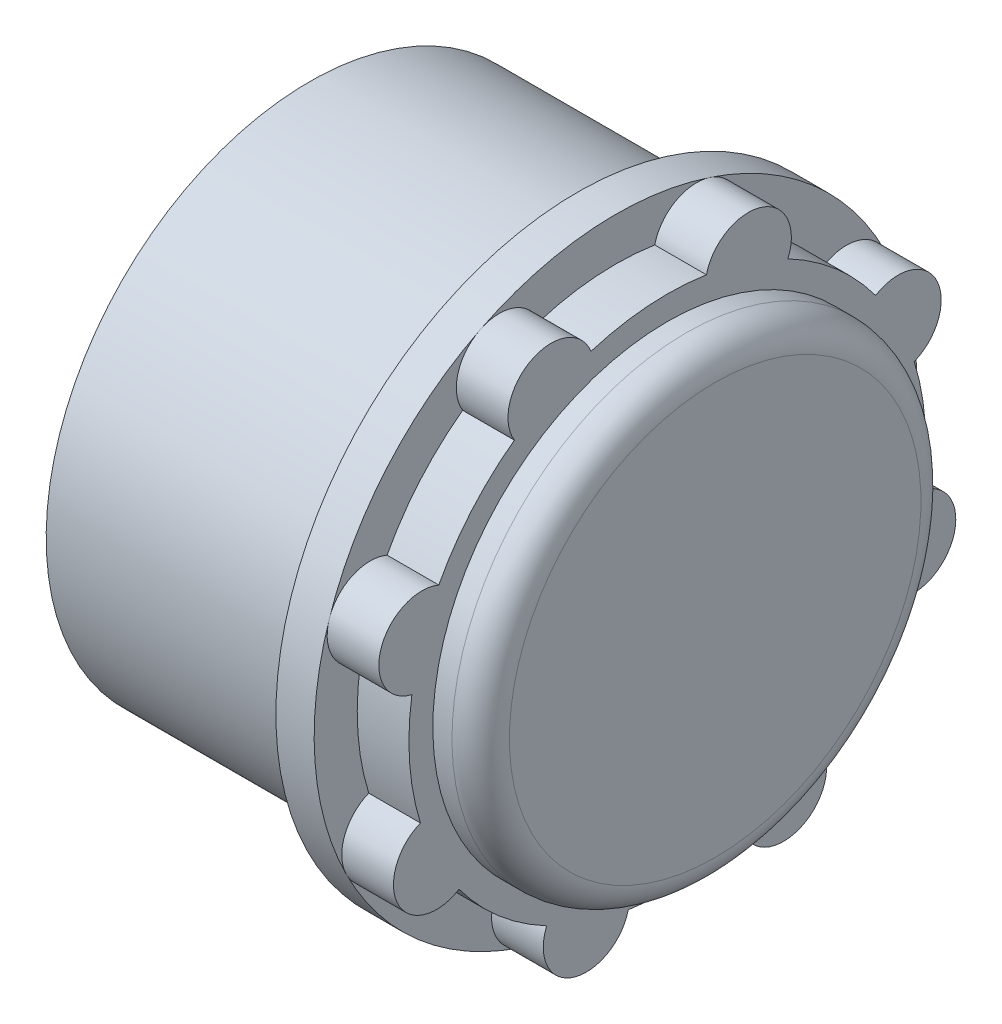
ISO-10303-21;
HEADER;
FILE_DESCRIPTION(('STEP AP214'),'2;1');
FILE_NAME('part.step','',(''),(''),'','','');
FILE_SCHEMA(('AUTOMOTIVE_DESIGN { 1 0 10303 214 1 1 1 1 }'));
ENDSEC;
DATA;
#1=APPLICATION_CONTEXT('core data for automotive mechanical design processes');
#2=APPLICATION_PROTOCOL_DEFINITION('international standard','automotive_design',2000,#1);
#3=PRODUCT_CONTEXT('',#1,'mechanical');
#4=PRODUCT('Part','Part','',(#3));
#5=PRODUCT_RELATED_PRODUCT_CATEGORY('part','',(#4));
#6=PRODUCT_DEFINITION_FORMATION('','',#4);
#7=PRODUCT_DEFINITION_CONTEXT('part definition',#1,'design');
#8=PRODUCT_DEFINITION('design','',#6,#7);
#9=PRODUCT_DEFINITION_SHAPE('','',#8);
#10=(LENGTH_UNIT() NAMED_UNIT(*) SI_UNIT(.MILLI.,.METRE.));
#11=(NAMED_UNIT(*) PLANE_ANGLE_UNIT() SI_UNIT($,.RADIAN.));
#12=(NAMED_UNIT(*) SI_UNIT($,.STERADIAN.) SOLID_ANGLE_UNIT());
#13=UNCERTAINTY_MEASURE_WITH_UNIT(LENGTH_MEASURE(1.E-05),#10,'distance_accuracy_value','');
#14=(GEOMETRIC_REPRESENTATION_CONTEXT(3) GLOBAL_UNCERTAINTY_ASSIGNED_CONTEXT((#13)) GLOBAL_UNIT_ASSIGNED_CONTEXT((#10,
#11,#12)) REPRESENTATION_CONTEXT('',''));
#15=CARTESIAN_POINT('',(0.,0.,0.));
#16=DIRECTION('',(0.,0.,1.));
#17=DIRECTION('',(1.,0.,0.));
#18=AXIS2_PLACEMENT_3D('',#15,#16,#17);
#19=CARTESIAN_POINT('',(2.,0.,0.));
#20=DIRECTION('',(1.,0.,0.));
#21=DIRECTION('',(0.,0.,-1.));
#22=AXIS2_PLACEMENT_3D('',#19,#20,#21);
#23=PLANE('',#22);
#24=CARTESIAN_POINT('',(2.,0.,0.));
#25=DIRECTION('',(1.,0.,0.));
#26=DIRECTION('',(0.,1.,0.));
#27=AXIS2_PLACEMENT_3D('',#24,#25,#26);
#28=CIRCLE('',#27,13.5);
#29=CARTESIAN_POINT('',(2.,-2.0425042619632,-13.3445935247149));
#30=VERTEX_POINT('',#29);
#31=CARTESIAN_POINT('',(2.,3.9869170359937,-12.8978483689375));
#32=VERTEX_POINT('',#31);
#33=EDGE_CURVE('E776',#30,#32,#28,.T.);
#34=ORIENTED_EDGE('',*,*,#33,.F.);
#35=CARTESIAN_POINT('',(2.,-4.23049904831431,-12.8200186350181));
#36=DIRECTION('',(1.,0.,0.));
#37=DIRECTION('',(0.,1.,0.));
#38=AXIS2_PLACEMENT_3D('',#35,#36,#37);
#39=CIRCLE('',#38,2.25);
#40=CARTESIAN_POINT('',(2.,-4.93558222303336,-14.9566884075211));
#41=VERTEX_POINT('',#40);
#42=EDGE_CURVE('E408',#41,#30,#39,.T.);
#43=ORIENTED_EDGE('',*,*,#42,.F.);
#44=CARTESIAN_POINT('',(2.,0.,0.));
#45=DIRECTION('',(1.,0.,0.));
#46=DIRECTION('',(0.,0.,-1.));
#47=AXIS2_PLACEMENT_3D('',#44,#45,#46);
#48=CIRCLE('',#47,15.75);
#49=CARTESIAN_POINT('',(2.,7.08599213804178,-14.0659594560631));
#50=VERTEX_POINT('',#49);
#51=EDGE_CURVE('E229',#41,#50,#48,.T.);
#52=ORIENTED_EDGE('',*,*,#51,.T.);
#53=CARTESIAN_POINT('',(2.,6.07370754689295,-12.0565366766255));
#54=DIRECTION('',(1.,0.,0.));
#55=DIRECTION('',(0.,1.,0.));
#56=AXIS2_PLACEMENT_3D('',#53,#54,#55);
#57=CIRCLE('',#56,2.25);
#58=EDGE_CURVE('E775',#32,#50,#57,.T.);
#59=ORIENTED_EDGE('',*,*,#58,.F.);
#60=EDGE_LOOP('',(#34,#43,#52,#59));
#61=FACE_BOUND('',#60,.T.);
#62=ADVANCED_FACE('F55',(#61),#23,.T.);
#63=CARTESIAN_POINT('',(2.,7.9917839592674,-10.8803211877406));
#64=VERTEX_POINT('',#63);
#65=EDGE_CURVE('E742',#50,#64,#57,.T.);
#66=ORIENTED_EDGE('',*,*,#65,.F.);
#67=CARTESIAN_POINT('',(2.,14.9566884075212,-4.93558222303331));
#68=VERTEX_POINT('',#67);
#69=EDGE_CURVE('E235',#50,#68,#48,.T.);
#70=ORIENTED_EDGE('',*,*,#69,.T.);
#71=CARTESIAN_POINT('',(2.,12.8200186350181,-4.23049904831426));
#72=DIRECTION('',(1.,0.,0.));
#73=DIRECTION('',(0.,1.,0.));
#74=AXIS2_PLACEMENT_3D('',#71,#72,#73);
#75=CIRCLE('',#74,2.25000000000001);
#76=CARTESIAN_POINT('',(2.,11.9393321165709,-6.30097997221221));
#77=VERTEX_POINT('',#76);
#78=EDGE_CURVE('E332',#77,#68,#75,.T.);
#79=ORIENTED_EDGE('',*,*,#78,.F.);
#80=CARTESIAN_POINT('',(2.,0.,0.));
#81=DIRECTION('',(1.,0.,0.));
#82=DIRECTION('',(0.,1.,0.));
#83=AXIS2_PLACEMENT_3D('',#80,#81,#82);
#84=CIRCLE('',#83,13.5);
#85=EDGE_CURVE('E739',#64,#77,#84,.T.);
#86=ORIENTED_EDGE('',*,*,#85,.F.);
#87=EDGE_LOOP('',(#66,#70,#79,#86));
#88=FACE_BOUND('',#87,.T.);
#89=ADVANCED_FACE('F264',(#88),#23,.T.);
#90=CARTESIAN_POINT('',(2.,-6.30097997221226,-11.9393321165708));
#91=VERTEX_POINT('',#90);
#92=EDGE_CURVE('E779',#91,#41,#39,.T.);
#93=ORIENTED_EDGE('',*,*,#92,.F.);
#94=CARTESIAN_POINT('',(2.,0.,0.));
#95=DIRECTION('',(1.,0.,0.));
#96=DIRECTION('',(0.,1.,0.));
#97=AXIS2_PLACEMENT_3D('',#94,#95,#96);
#98=CIRCLE('',#97,13.5);
#99=CARTESIAN_POINT('',(2.,-10.8803211877406,-7.99178395926736));
#100=VERTEX_POINT('',#99);
#101=EDGE_CURVE('E787',#100,#91,#98,.T.);
#102=ORIENTED_EDGE('',*,*,#101,.F.);
#103=CARTESIAN_POINT('',(2.,-12.0565366766255,-6.07370754689291));
#104=DIRECTION('',(1.,0.,0.));
#105=DIRECTION('',(0.,1.,0.));
#106=AXIS2_PLACEMENT_3D('',#103,#104,#105);
#107=CIRCLE('',#106,2.25);
#108=CARTESIAN_POINT('',(2.,-14.0659594560631,-7.08599213804173));
#109=VERTEX_POINT('',#108);
#110=EDGE_CURVE('E782',#109,#100,#107,.T.);
#111=ORIENTED_EDGE('',*,*,#110,.F.);
#112=EDGE_CURVE('E762',#109,#41,#48,.T.);
#113=ORIENTED_EDGE('',*,*,#112,.T.);
#114=EDGE_LOOP('',(#93,#102,#111,#113));
#115=FACE_BOUND('',#114,.T.);
#116=ADVANCED_FACE('F271',(#115),#23,.T.);
#117=CARTESIAN_POINT('',(2.,-12.8978483689375,-3.98691703599366));
#118=VERTEX_POINT('',#117);
#119=EDGE_CURVE('E792',#118,#109,#107,.T.);
#120=ORIENTED_EDGE('',*,*,#119,.F.);
#121=CARTESIAN_POINT('',(2.,0.,0.));
#122=DIRECTION('',(1.,0.,0.));
#123=DIRECTION('',(0.,1.,0.));
#124=AXIS2_PLACEMENT_3D('',#121,#122,#123);
#125=CIRCLE('',#124,13.5);
#126=CARTESIAN_POINT('',(2.,-13.3445935247149,2.04250426196324));
#127=VERTEX_POINT('',#126);
#128=EDGE_CURVE('E797',#127,#118,#125,.T.);
#129=ORIENTED_EDGE('',*,*,#128,.F.);
#130=CARTESIAN_POINT('',(2.,-12.8200186350181,4.23049904831435));
#131=DIRECTION('',(1.,0.,0.));
#132=DIRECTION('',(0.,1.,0.));
#133=AXIS2_PLACEMENT_3D('',#130,#131,#132);
#134=CIRCLE('',#133,2.25);
#135=CARTESIAN_POINT('',(2.00000000000001,-14.9566884075211,4.93558222303341));
#136=VERTEX_POINT('',#135);
#137=EDGE_CURVE('E330',#136,#127,#134,.T.);
#138=ORIENTED_EDGE('',*,*,#137,.F.);
#139=EDGE_CURVE('E757',#136,#109,#48,.T.);
#140=ORIENTED_EDGE('',*,*,#139,.T.);
#141=EDGE_LOOP('',(#120,#129,#138,#140));
#142=FACE_BOUND('',#141,.T.);
#143=ADVANCED_FACE('F682',(#142),#23,.T.);
#144=CARTESIAN_POINT('',(2.,13.3445935247149,-2.04250426196314));
#145=VERTEX_POINT('',#144);
#146=EDGE_CURVE('E321',#68,#145,#75,.T.);
#147=ORIENTED_EDGE('',*,*,#146,.F.);
#148=CARTESIAN_POINT('',(2.,14.0659594560631,7.08599213804183));
#149=VERTEX_POINT('',#148);
#150=EDGE_CURVE('E238',#68,#149,#48,.T.);
#151=ORIENTED_EDGE('',*,*,#150,.T.);
#152=CARTESIAN_POINT('',(2.,12.0565366766255,6.07370754689299));
#153=DIRECTION('',(1.,0.,0.));
#154=DIRECTION('',(0.,1.,0.));
#155=AXIS2_PLACEMENT_3D('',#152,#153,#154);
#156=CIRCLE('',#155,2.25);
#157=CARTESIAN_POINT('',(2.,12.8978483689375,3.98691703599376));
#158=VERTEX_POINT('',#157);
#159=EDGE_CURVE('E340',#158,#149,#156,.T.);
#160=ORIENTED_EDGE('',*,*,#159,.F.);
#161=CARTESIAN_POINT('',(2.,0.,0.));
#162=DIRECTION('',(1.,0.,0.));
#163=DIRECTION('',(0.,1.,0.));
#164=AXIS2_PLACEMENT_3D('',#161,#162,#163);
#165=CIRCLE('',#164,13.5);
#166=EDGE_CURVE('E216',#145,#158,#165,.T.);
#167=ORIENTED_EDGE('',*,*,#166,.F.);
#168=EDGE_LOOP('',(#147,#151,#160,#167));
#169=FACE_BOUND('',#168,.T.);
#170=ADVANCED_FACE('F294',(#169),#23,.T.);
#171=CARTESIAN_POINT('',(2.,-11.9393321165708,6.30097997221228));
#172=VERTEX_POINT('',#171);
#173=EDGE_CURVE('E316',#172,#136,#134,.T.);
#174=ORIENTED_EDGE('',*,*,#173,.F.);
#175=CARTESIAN_POINT('',(2.,0.,0.));
#176=DIRECTION('',(1.,0.,0.));
#177=DIRECTION('',(0.,1.,0.));
#178=AXIS2_PLACEMENT_3D('',#175,#176,#177);
#179=CIRCLE('',#178,13.5);
#180=CARTESIAN_POINT('',(2.,-7.99178395926732,10.8803211877406));
#181=VERTEX_POINT('',#180);
#182=EDGE_CURVE('E309',#181,#172,#179,.T.);
#183=ORIENTED_EDGE('',*,*,#182,.F.);
#184=CARTESIAN_POINT('',(2.,-6.07370754689287,12.0565366766255));
#185=DIRECTION('',(1.,0.,0.));
#186=DIRECTION('',(0.,1.,0.));
#187=AXIS2_PLACEMENT_3D('',#184,#185,#186);
#188=CIRCLE('',#187,2.25);
#189=CARTESIAN_POINT('',(2.,-7.08599213804168,14.0659594560631));
#190=VERTEX_POINT('',#189);
#191=EDGE_CURVE('E311',#190,#181,#188,.T.);
#192=ORIENTED_EDGE('',*,*,#191,.F.);
#193=EDGE_CURVE('E754',#190,#136,#48,.T.);
#194=ORIENTED_EDGE('',*,*,#193,.T.);
#195=EDGE_LOOP('',(#174,#183,#192,#194));
#196=FACE_BOUND('',#195,.T.);
#197=ADVANCED_FACE('F289',(#196),#23,.T.);
#198=CARTESIAN_POINT('',(2.,-3.98691703599362,12.8978483689375));
#199=VERTEX_POINT('',#198);
#200=EDGE_CURVE('E299',#199,#190,#188,.T.);
#201=ORIENTED_EDGE('',*,*,#200,.F.);
#202=CARTESIAN_POINT('',(2.,0.,0.));
#203=DIRECTION('',(1.,0.,0.));
#204=DIRECTION('',(0.,1.,0.));
#205=AXIS2_PLACEMENT_3D('',#202,#203,#204);
#206=CIRCLE('',#205,13.5);
#207=CARTESIAN_POINT('',(2.,2.04250426196328,13.3445935247149));
#208=VERTEX_POINT('',#207);
#209=EDGE_CURVE('E302',#208,#199,#206,.T.);
#210=ORIENTED_EDGE('',*,*,#209,.F.);
#211=CARTESIAN_POINT('',(2.,4.2304990483144,12.8200186350181));
#212=DIRECTION('',(1.,0.,0.));
#213=DIRECTION('',(0.,1.,0.));
#214=AXIS2_PLACEMENT_3D('',#211,#212,#213);
#215=CIRCLE('',#214,2.25000000000001);
#216=CARTESIAN_POINT('',(2.,4.93558222303346,14.9566884075211));
#217=VERTEX_POINT('',#216);
#218=EDGE_CURVE('E322',#217,#208,#215,.T.);
#219=ORIENTED_EDGE('',*,*,#218,.F.);
#220=EDGE_CURVE('E304',#217,#190,#48,.T.);
#221=ORIENTED_EDGE('',*,*,#220,.T.);
#222=EDGE_LOOP('',(#201,#210,#219,#221));
#223=FACE_BOUND('',#222,.T.);
#224=ADVANCED_FACE('F280',(#223),#23,.T.);
#225=CARTESIAN_POINT('',(2.,0.,0.));
#226=DIRECTION('',(-1.,0.,0.));
#227=DIRECTION('',(0.,0.,1.));
#228=AXIS2_PLACEMENT_3D('',#225,#226,#227);
#229=CYLINDRICAL_SURFACE('',#228,15.75);
#230=ORIENTED_EDGE('',*,*,#69,.F.);
#231=ORIENTED_EDGE('',*,*,#51,.F.);
#232=ORIENTED_EDGE('',*,*,#112,.F.);
#233=ORIENTED_EDGE('',*,*,#139,.F.);
#234=ORIENTED_EDGE('',*,*,#193,.F.);
#235=ORIENTED_EDGE('',*,*,#220,.F.);
#236=EDGE_CURVE('E748',#149,#217,#48,.T.);
#237=ORIENTED_EDGE('',*,*,#236,.F.);
#238=ORIENTED_EDGE('',*,*,#150,.F.);
#239=EDGE_LOOP('',(#230,#231,#232,#233,#234,#235,#237,#238));
#240=FACE_BOUND('',#239,.T.);
#241=CARTESIAN_POINT('',(0.,0.,0.));
#242=DIRECTION('',(1.,0.,0.));
#243=DIRECTION('',(0.,0.,-1.));
#244=AXIS2_PLACEMENT_3D('',#241,#242,#243);
#245=CIRCLE('',#244,15.75);
#246=CARTESIAN_POINT('',(0.,0.,-15.75));
#247=VERTEX_POINT('',#246);
#248=EDGE_CURVE('E223',#247,#247,#245,.T.);
#249=ORIENTED_EDGE('',*,*,#248,.T.);
#250=EDGE_LOOP('',(#249));
#251=FACE_BOUND('',#250,.T.);
#252=ADVANCED_FACE('F278',(#240,#251),#229,.T.);
#253=CARTESIAN_POINT('',(2.,10.8803211877405,7.99178395926743));
#254=VERTEX_POINT('',#253);
#255=EDGE_CURVE('E221',#149,#254,#156,.T.);
#256=ORIENTED_EDGE('',*,*,#255,.F.);
#257=ORIENTED_EDGE('',*,*,#236,.T.);
#258=CARTESIAN_POINT('',(2.,6.30097997221233,11.9393321165708));
#259=VERTEX_POINT('',#258);
#260=EDGE_CURVE('E318',#259,#217,#215,.T.);
#261=ORIENTED_EDGE('',*,*,#260,.F.);
#262=CARTESIAN_POINT('',(2.,0.,0.));
#263=DIRECTION('',(1.,0.,0.));
#264=DIRECTION('',(0.,1.,0.));
#265=AXIS2_PLACEMENT_3D('',#262,#263,#264);
#266=CIRCLE('',#265,13.5);
#267=EDGE_CURVE('E343',#254,#259,#266,.T.);
#268=ORIENTED_EDGE('',*,*,#267,.F.);
#269=EDGE_LOOP('',(#256,#257,#261,#268));
#270=FACE_BOUND('',#269,.T.);
#271=ADVANCED_FACE('F267',(#270),#23,.T.);
#272=CARTESIAN_POINT('',(0.,0.,0.));
#273=DIRECTION('',(1.,0.,0.));
#274=DIRECTION('',(0.,0.,-1.));
#275=AXIS2_PLACEMENT_3D('',#272,#273,#274);
#276=PLANE('',#275);
#277=CARTESIAN_POINT('',(0.,0.,0.));
#278=DIRECTION('',(-1.,0.,0.));
#279=DIRECTION('',(0.,-1.,0.));
#280=AXIS2_PLACEMENT_3D('',#277,#278,#279);
#281=CIRCLE('',#280,13.75);
#282=CARTESIAN_POINT('',(0.,-13.75,0.));
#283=VERTEX_POINT('',#282);
#284=EDGE_CURVE('E245',#283,#283,#281,.T.);
#285=ORIENTED_EDGE('',*,*,#284,.F.);
#286=EDGE_LOOP('',(#285));
#287=FACE_BOUND('',#286,.T.);
#288=ORIENTED_EDGE('',*,*,#248,.F.);
#289=EDGE_LOOP('',(#288));
#290=FACE_BOUND('',#289,.T.);
#291=ADVANCED_FACE('F277',(#287,#290),#276,.F.);
#292=CARTESIAN_POINT('',(4.7,12.0565366766255,6.07370754689299));
#293=DIRECTION('',(-1.,0.,0.));
#294=DIRECTION('',(0.,-1.,0.));
#295=AXIS2_PLACEMENT_3D('',#292,#293,#294);
#296=CYLINDRICAL_SURFACE('',#295,2.25);
#297=ORIENTED_EDGE('',*,*,#159,.T.);
#298=ORIENTED_EDGE('',*,*,#255,.T.);
#299=DIRECTION('',(-1.,0.,0.));
#300=VECTOR('',#299,1.);
#301=CARTESIAN_POINT('',(4.7,10.8803211877405,7.99178395926743));
#302=LINE('',#301,#300);
#303=CARTESIAN_POINT('',(4.7,10.8803211877405,7.99178395926743));
#304=VERTEX_POINT('',#303);
#305=EDGE_CURVE('E200',#304,#254,#302,.T.);
#306=ORIENTED_EDGE('',*,*,#305,.F.);
#307=CARTESIAN_POINT('',(4.7,12.0565366766255,6.07370754689299));
#308=DIRECTION('',(1.,0.,0.));
#309=DIRECTION('',(0.,1.,0.));
#310=AXIS2_PLACEMENT_3D('',#307,#308,#309);
#311=CIRCLE('',#310,2.25);
#312=CARTESIAN_POINT('',(4.7,12.8978483689375,3.98691703599376));
#313=VERTEX_POINT('',#312);
#314=EDGE_CURVE('E207',#313,#304,#311,.T.);
#315=ORIENTED_EDGE('',*,*,#314,.F.);
#316=DIRECTION('',(-1.,0.,0.));
#317=VECTOR('',#316,1.);
#318=CARTESIAN_POINT('',(4.7,12.8978483689375,3.98691703599376));
#319=LINE('',#318,#317);
#320=EDGE_CURVE('E354',#313,#158,#319,.T.);
#321=ORIENTED_EDGE('',*,*,#320,.T.);
#322=EDGE_LOOP('',(#297,#298,#306,#315,#321));
#323=FACE_BOUND('',#322,.T.);
#324=ADVANCED_FACE('F220',(#323),#296,.T.);
#325=CARTESIAN_POINT('',(4.7,0.,0.));
#326=DIRECTION('',(-1.,0.,0.));
#327=DIRECTION('',(0.,-1.,0.));
#328=AXIS2_PLACEMENT_3D('',#325,#326,#327);
#329=CYLINDRICAL_SURFACE('',#328,13.5);
#330=ORIENTED_EDGE('',*,*,#267,.T.);
#331=DIRECTION('',(-1.,0.,0.));
#332=VECTOR('',#331,1.);
#333=CARTESIAN_POINT('',(4.7,6.30097997221233,11.9393321165708));
#334=LINE('',#333,#332);
#335=CARTESIAN_POINT('',(4.7,6.30097997221233,11.9393321165708));
#336=VERTEX_POINT('',#335);
#337=EDGE_CURVE('E202',#336,#259,#334,.T.);
#338=ORIENTED_EDGE('',*,*,#337,.F.);
#339=CARTESIAN_POINT('',(4.7,0.,0.));
#340=DIRECTION('',(1.,0.,0.));
#341=DIRECTION('',(0.,1.,0.));
#342=AXIS2_PLACEMENT_3D('',#339,#340,#341);
#343=CIRCLE('',#342,13.5);
#344=EDGE_CURVE('E195',#304,#336,#343,.T.);
#345=ORIENTED_EDGE('',*,*,#344,.F.);
#346=ORIENTED_EDGE('',*,*,#305,.T.);
#347=EDGE_LOOP('',(#330,#338,#345,#346));
#348=FACE_BOUND('',#347,.T.);
#349=ADVANCED_FACE('F198',(#348),#329,.T.);
#350=CARTESIAN_POINT('',(4.7,4.2304990483144,12.8200186350181));
#351=DIRECTION('',(-1.,0.,0.));
#352=DIRECTION('',(0.,-1.,0.));
#353=AXIS2_PLACEMENT_3D('',#350,#351,#352);
#354=CYLINDRICAL_SURFACE('',#353,2.25000000000001);
#355=ORIENTED_EDGE('',*,*,#260,.T.);
#356=ORIENTED_EDGE('',*,*,#218,.T.);
#357=DIRECTION('',(-1.,0.,0.));
#358=VECTOR('',#357,1.);
#359=CARTESIAN_POINT('',(4.7,2.04250426196328,13.3445935247149));
#360=LINE('',#359,#358);
#361=CARTESIAN_POINT('',(4.7,2.04250426196328,13.3445935247149));
#362=VERTEX_POINT('',#361);
#363=EDGE_CURVE('E231',#362,#208,#360,.T.);
#364=ORIENTED_EDGE('',*,*,#363,.F.);
#365=CARTESIAN_POINT('',(4.7,4.2304990483144,12.8200186350181));
#366=DIRECTION('',(1.,0.,0.));
#367=DIRECTION('',(0.,1.,0.));
#368=AXIS2_PLACEMENT_3D('',#365,#366,#367);
#369=CIRCLE('',#368,2.25000000000001);
#370=EDGE_CURVE('E206',#336,#362,#369,.T.);
#371=ORIENTED_EDGE('',*,*,#370,.F.);
#372=ORIENTED_EDGE('',*,*,#337,.T.);
#373=EDGE_LOOP('',(#355,#356,#364,#371,#372));
#374=FACE_BOUND('',#373,.T.);
#375=ADVANCED_FACE('F500',(#374),#354,.T.);
#376=CARTESIAN_POINT('',(4.7,0.,0.));
#377=DIRECTION('',(-1.,0.,0.));
#378=DIRECTION('',(0.,-1.,0.));
#379=AXIS2_PLACEMENT_3D('',#376,#377,#378);
#380=CYLINDRICAL_SURFACE('',#379,13.5);
#381=ORIENTED_EDGE('',*,*,#209,.T.);
#382=DIRECTION('',(-1.,0.,0.));
#383=VECTOR('',#382,1.);
#384=CARTESIAN_POINT('',(4.7,-3.98691703599362,12.8978483689375));
#385=LINE('',#384,#383);
#386=CARTESIAN_POINT('',(4.7,-3.98691703599362,12.8978483689375));
#387=VERTEX_POINT('',#386);
#388=EDGE_CURVE('E831',#387,#199,#385,.T.);
#389=ORIENTED_EDGE('',*,*,#388,.F.);
#390=CARTESIAN_POINT('',(4.7,0.,0.));
#391=DIRECTION('',(1.,0.,0.));
#392=DIRECTION('',(0.,1.,0.));
#393=AXIS2_PLACEMENT_3D('',#390,#391,#392);
#394=CIRCLE('',#393,13.5);
#395=EDGE_CURVE('E398',#362,#387,#394,.T.);
#396=ORIENTED_EDGE('',*,*,#395,.F.);
#397=ORIENTED_EDGE('',*,*,#363,.T.);
#398=EDGE_LOOP('',(#381,#389,#396,#397));
#399=FACE_BOUND('',#398,.T.);
#400=ADVANCED_FACE('F497',(#399),#380,.T.);
#401=CARTESIAN_POINT('',(4.7,-6.07370754689287,12.0565366766255));
#402=DIRECTION('',(-1.,0.,0.));
#403=DIRECTION('',(0.,-1.,0.));
#404=AXIS2_PLACEMENT_3D('',#401,#402,#403);
#405=CYLINDRICAL_SURFACE('',#404,2.25);
#406=ORIENTED_EDGE('',*,*,#200,.T.);
#407=ORIENTED_EDGE('',*,*,#191,.T.);
#408=DIRECTION('',(-1.,0.,0.));
#409=VECTOR('',#408,1.);
#410=CARTESIAN_POINT('',(4.7,-7.99178395926732,10.8803211877406));
#411=LINE('',#410,#409);
#412=CARTESIAN_POINT('',(4.7,-7.99178395926732,10.8803211877406));
#413=VERTEX_POINT('',#412);
#414=EDGE_CURVE('E824',#413,#181,#411,.T.);
#415=ORIENTED_EDGE('',*,*,#414,.F.);
#416=CARTESIAN_POINT('',(4.7,-6.07370754689287,12.0565366766255));
#417=DIRECTION('',(1.,0.,0.));
#418=DIRECTION('',(0.,1.,0.));
#419=AXIS2_PLACEMENT_3D('',#416,#417,#418);
#420=CIRCLE('',#419,2.25);
#421=EDGE_CURVE('E394',#387,#413,#420,.T.);
#422=ORIENTED_EDGE('',*,*,#421,.F.);
#423=ORIENTED_EDGE('',*,*,#388,.T.);
#424=EDGE_LOOP('',(#406,#407,#415,#422,#423));
#425=FACE_BOUND('',#424,.T.);
#426=ADVANCED_FACE('F493',(#425),#405,.T.);
#427=CARTESIAN_POINT('',(4.7,0.,0.));
#428=DIRECTION('',(-1.,0.,0.));
#429=DIRECTION('',(0.,-1.,0.));
#430=AXIS2_PLACEMENT_3D('',#427,#428,#429);
#431=CYLINDRICAL_SURFACE('',#430,13.5);
#432=ORIENTED_EDGE('',*,*,#182,.T.);
#433=DIRECTION('',(-1.,0.,0.));
#434=VECTOR('',#433,1.);
#435=CARTESIAN_POINT('',(4.7,-11.9393321165708,6.30097997221228));
#436=LINE('',#435,#434);
#437=CARTESIAN_POINT('',(4.7,-11.9393321165708,6.30097997221228));
#438=VERTEX_POINT('',#437);
#439=EDGE_CURVE('E819',#438,#172,#436,.T.);
#440=ORIENTED_EDGE('',*,*,#439,.F.);
#441=CARTESIAN_POINT('',(4.7,0.,0.));
#442=DIRECTION('',(1.,0.,0.));
#443=DIRECTION('',(0.,1.,0.));
#444=AXIS2_PLACEMENT_3D('',#441,#442,#443);
#445=CIRCLE('',#444,13.5);
#446=EDGE_CURVE('E390',#413,#438,#445,.T.);
#447=ORIENTED_EDGE('',*,*,#446,.F.);
#448=ORIENTED_EDGE('',*,*,#414,.T.);
#449=EDGE_LOOP('',(#432,#440,#447,#448));
#450=FACE_BOUND('',#449,.T.);
#451=ADVANCED_FACE('F489',(#450),#431,.T.);
#452=CARTESIAN_POINT('',(4.70000000000001,-12.8200186350181,4.23049904831435));
#453=DIRECTION('',(-1.,0.,0.));
#454=DIRECTION('',(0.,-1.,0.));
#455=AXIS2_PLACEMENT_3D('',#452,#453,#454);
#456=CYLINDRICAL_SURFACE('',#455,2.25);
#457=ORIENTED_EDGE('',*,*,#173,.T.);
#458=ORIENTED_EDGE('',*,*,#137,.T.);
#459=DIRECTION('',(-1.,0.,0.));
#460=VECTOR('',#459,1.);
#461=CARTESIAN_POINT('',(4.7,-13.3445935247149,2.04250426196324));
#462=LINE('',#461,#460);
#463=CARTESIAN_POINT('',(4.7,-13.3445935247149,2.04250426196324));
#464=VERTEX_POINT('',#463);
#465=EDGE_CURVE('E817',#464,#127,#462,.T.);
#466=ORIENTED_EDGE('',*,*,#465,.F.);
#467=CARTESIAN_POINT('',(4.70000000000001,-12.8200186350181,4.23049904831435));
#468=DIRECTION('',(1.,0.,0.));
#469=DIRECTION('',(0.,1.,0.));
#470=AXIS2_PLACEMENT_3D('',#467,#468,#469);
#471=CIRCLE('',#470,2.25);
#472=EDGE_CURVE('E386',#438,#464,#471,.T.);
#473=ORIENTED_EDGE('',*,*,#472,.F.);
#474=ORIENTED_EDGE('',*,*,#439,.T.);
#475=EDGE_LOOP('',(#457,#458,#466,#473,#474));
#476=FACE_BOUND('',#475,.T.);
#477=ADVANCED_FACE('F485',(#476),#456,.T.);
#478=CARTESIAN_POINT('',(4.7,0.,0.));
#479=DIRECTION('',(-1.,0.,0.));
#480=DIRECTION('',(0.,-1.,0.));
#481=AXIS2_PLACEMENT_3D('',#478,#479,#480);
#482=CYLINDRICAL_SURFACE('',#481,13.5);
#483=ORIENTED_EDGE('',*,*,#128,.T.);
#484=DIRECTION('',(-1.,0.,0.));
#485=VECTOR('',#484,1.);
#486=CARTESIAN_POINT('',(4.7,-12.8978483689375,-3.98691703599366));
#487=LINE('',#486,#485);
#488=CARTESIAN_POINT('',(4.7,-12.8978483689375,-3.98691703599366));
#489=VERTEX_POINT('',#488);
#490=EDGE_CURVE('E816',#489,#118,#487,.T.);
#491=ORIENTED_EDGE('',*,*,#490,.F.);
#492=CARTESIAN_POINT('',(4.7,0.,0.));
#493=DIRECTION('',(1.,0.,0.));
#494=DIRECTION('',(0.,1.,0.));
#495=AXIS2_PLACEMENT_3D('',#492,#493,#494);
#496=CIRCLE('',#495,13.5);
#497=EDGE_CURVE('E382',#464,#489,#496,.T.);
#498=ORIENTED_EDGE('',*,*,#497,.F.);
#499=ORIENTED_EDGE('',*,*,#465,.T.);
#500=EDGE_LOOP('',(#483,#491,#498,#499));
#501=FACE_BOUND('',#500,.T.);
#502=ADVANCED_FACE('F481',(#501),#482,.T.);
#503=CARTESIAN_POINT('',(4.7,-12.0565366766255,-6.07370754689291));
#504=DIRECTION('',(-1.,0.,0.));
#505=DIRECTION('',(0.,-1.,0.));
#506=AXIS2_PLACEMENT_3D('',#503,#504,#505);
#507=CYLINDRICAL_SURFACE('',#506,2.25);
#508=ORIENTED_EDGE('',*,*,#119,.T.);
#509=ORIENTED_EDGE('',*,*,#110,.T.);
#510=DIRECTION('',(-1.,0.,0.));
#511=VECTOR('',#510,1.);
#512=CARTESIAN_POINT('',(4.7,-10.8803211877406,-7.99178395926736));
#513=LINE('',#512,#511);
#514=CARTESIAN_POINT('',(4.7,-10.8803211877406,-7.99178395926736));
#515=VERTEX_POINT('',#514);
#516=EDGE_CURVE('E814',#515,#100,#513,.T.);
#517=ORIENTED_EDGE('',*,*,#516,.F.);
#518=CARTESIAN_POINT('',(4.7,-12.0565366766255,-6.07370754689291));
#519=DIRECTION('',(1.,0.,0.));
#520=DIRECTION('',(0.,1.,0.));
#521=AXIS2_PLACEMENT_3D('',#518,#519,#520);
#522=CIRCLE('',#521,2.25);
#523=EDGE_CURVE('E378',#489,#515,#522,.T.);
#524=ORIENTED_EDGE('',*,*,#523,.F.);
#525=ORIENTED_EDGE('',*,*,#490,.T.);
#526=EDGE_LOOP('',(#508,#509,#517,#524,#525));
#527=FACE_BOUND('',#526,.T.);
#528=ADVANCED_FACE('F477',(#527),#507,.T.);
#529=CARTESIAN_POINT('',(4.7,0.,0.));
#530=DIRECTION('',(-1.,0.,0.));
#531=DIRECTION('',(0.,-1.,0.));
#532=AXIS2_PLACEMENT_3D('',#529,#530,#531);
#533=CYLINDRICAL_SURFACE('',#532,13.5);
#534=ORIENTED_EDGE('',*,*,#101,.T.);
#535=DIRECTION('',(-1.,0.,0.));
#536=VECTOR('',#535,1.);
#537=CARTESIAN_POINT('',(4.7,-6.30097997221226,-11.9393321165708));
#538=LINE('',#537,#536);
#539=CARTESIAN_POINT('',(4.7,-6.30097997221226,-11.9393321165708));
#540=VERTEX_POINT('',#539);
#541=EDGE_CURVE('E837',#540,#91,#538,.T.);
#542=ORIENTED_EDGE('',*,*,#541,.F.);
#543=CARTESIAN_POINT('',(4.7,0.,0.));
#544=DIRECTION('',(1.,0.,0.));
#545=DIRECTION('',(0.,1.,0.));
#546=AXIS2_PLACEMENT_3D('',#543,#544,#545);
#547=CIRCLE('',#546,13.5);
#548=EDGE_CURVE('E374',#515,#540,#547,.T.);
#549=ORIENTED_EDGE('',*,*,#548,.F.);
#550=ORIENTED_EDGE('',*,*,#516,.T.);
#551=EDGE_LOOP('',(#534,#542,#549,#550));
#552=FACE_BOUND('',#551,.T.);
#553=ADVANCED_FACE('F473',(#552),#533,.T.);
#554=CARTESIAN_POINT('',(4.7,-4.23049904831431,-12.8200186350181));
#555=DIRECTION('',(-1.,0.,0.));
#556=DIRECTION('',(0.,-1.,0.));
#557=AXIS2_PLACEMENT_3D('',#554,#555,#556);
#558=CYLINDRICAL_SURFACE('',#557,2.25);
#559=ORIENTED_EDGE('',*,*,#92,.T.);
#560=ORIENTED_EDGE('',*,*,#42,.T.);
#561=DIRECTION('',(-1.,0.,0.));
#562=VECTOR('',#561,1.);
#563=CARTESIAN_POINT('',(4.7,-2.0425042619632,-13.3445935247149));
#564=LINE('',#563,#562);
#565=CARTESIAN_POINT('',(4.7,-2.0425042619632,-13.3445935247149));
#566=VERTEX_POINT('',#565);
#567=EDGE_CURVE('E71',#566,#30,#564,.T.);
#568=ORIENTED_EDGE('',*,*,#567,.F.);
#569=CARTESIAN_POINT('',(4.7,-4.23049904831431,-12.8200186350181));
#570=DIRECTION('',(1.,0.,0.));
#571=DIRECTION('',(0.,1.,0.));
#572=AXIS2_PLACEMENT_3D('',#569,#570,#571);
#573=CIRCLE('',#572,2.25);
#574=EDGE_CURVE('E370',#540,#566,#573,.T.);
#575=ORIENTED_EDGE('',*,*,#574,.F.);
#576=ORIENTED_EDGE('',*,*,#541,.T.);
#577=EDGE_LOOP('',(#559,#560,#568,#575,#576));
#578=FACE_BOUND('',#577,.T.);
#579=ADVANCED_FACE('F470',(#578),#558,.T.);
#580=CARTESIAN_POINT('',(4.7,0.,0.));
#581=DIRECTION('',(-1.,0.,0.));
#582=DIRECTION('',(0.,-1.,0.));
#583=AXIS2_PLACEMENT_3D('',#580,#581,#582);
#584=CYLINDRICAL_SURFACE('',#583,13.5);
#585=ORIENTED_EDGE('',*,*,#33,.T.);
#586=DIRECTION('',(-1.,0.,0.));
#587=VECTOR('',#586,1.);
#588=CARTESIAN_POINT('',(4.7,3.9869170359937,-12.8978483689375));
#589=LINE('',#588,#587);
#590=CARTESIAN_POINT('',(4.7,3.9869170359937,-12.8978483689375));
#591=VERTEX_POINT('',#590);
#592=EDGE_CURVE('E79',#591,#32,#589,.T.);
#593=ORIENTED_EDGE('',*,*,#592,.F.);
#594=CARTESIAN_POINT('',(4.7,0.,0.));
#595=DIRECTION('',(1.,0.,0.));
#596=DIRECTION('',(0.,1.,0.));
#597=AXIS2_PLACEMENT_3D('',#594,#595,#596);
#598=CIRCLE('',#597,13.5);
#599=EDGE_CURVE('E366',#566,#591,#598,.T.);
#600=ORIENTED_EDGE('',*,*,#599,.F.);
#601=ORIENTED_EDGE('',*,*,#567,.T.);
#602=EDGE_LOOP('',(#585,#593,#600,#601));
#603=FACE_BOUND('',#602,.T.);
#604=ADVANCED_FACE('F467',(#603),#584,.T.);
#605=CARTESIAN_POINT('',(4.7,6.07370754689295,-12.0565366766255));
#606=DIRECTION('',(-1.,0.,0.));
#607=DIRECTION('',(0.,-1.,0.));
#608=AXIS2_PLACEMENT_3D('',#605,#606,#607);
#609=CYLINDRICAL_SURFACE('',#608,2.25);
#610=ORIENTED_EDGE('',*,*,#58,.T.);
#611=ORIENTED_EDGE('',*,*,#65,.T.);
#612=DIRECTION('',(-1.,0.,0.));
#613=VECTOR('',#612,1.);
#614=CARTESIAN_POINT('',(4.7,7.9917839592674,-10.8803211877406));
#615=LINE('',#614,#613);
#616=CARTESIAN_POINT('',(4.7,7.9917839592674,-10.8803211877406));
#617=VERTEX_POINT('',#616);
#618=EDGE_CURVE('E847',#617,#64,#615,.T.);
#619=ORIENTED_EDGE('',*,*,#618,.F.);
#620=CARTESIAN_POINT('',(4.7,6.07370754689295,-12.0565366766255));
#621=DIRECTION('',(1.,0.,0.));
#622=DIRECTION('',(0.,1.,0.));
#623=AXIS2_PLACEMENT_3D('',#620,#621,#622);
#624=CIRCLE('',#623,2.25);
#625=EDGE_CURVE('E362',#591,#617,#624,.T.);
#626=ORIENTED_EDGE('',*,*,#625,.F.);
#627=ORIENTED_EDGE('',*,*,#592,.T.);
#628=EDGE_LOOP('',(#610,#611,#619,#626,#627));
#629=FACE_BOUND('',#628,.T.);
#630=ADVANCED_FACE('F463',(#629),#609,.T.);
#631=CARTESIAN_POINT('',(4.7,0.,0.));
#632=DIRECTION('',(-1.,0.,0.));
#633=DIRECTION('',(0.,-1.,0.));
#634=AXIS2_PLACEMENT_3D('',#631,#632,#633);
#635=CYLINDRICAL_SURFACE('',#634,13.5);
#636=ORIENTED_EDGE('',*,*,#85,.T.);
#637=DIRECTION('',(-1.,0.,0.));
#638=VECTOR('',#637,1.);
#639=CARTESIAN_POINT('',(4.7,11.9393321165709,-6.30097997221221));
#640=LINE('',#639,#638);
#641=CARTESIAN_POINT('',(4.7,11.9393321165709,-6.30097997221221));
#642=VERTEX_POINT('',#641);
#643=EDGE_CURVE('E735',#642,#77,#640,.T.);
#644=ORIENTED_EDGE('',*,*,#643,.F.);
#645=CARTESIAN_POINT('',(4.7,0.,0.));
#646=DIRECTION('',(1.,0.,0.));
#647=DIRECTION('',(0.,1.,0.));
#648=AXIS2_PLACEMENT_3D('',#645,#646,#647);
#649=CIRCLE('',#648,13.5);
#650=EDGE_CURVE('E358',#617,#642,#649,.T.);
#651=ORIENTED_EDGE('',*,*,#650,.F.);
#652=ORIENTED_EDGE('',*,*,#618,.T.);
#653=EDGE_LOOP('',(#636,#644,#651,#652));
#654=FACE_BOUND('',#653,.T.);
#655=ADVANCED_FACE('F459',(#654),#635,.T.);
#656=CARTESIAN_POINT('',(4.7,12.8200186350181,-4.23049904831426));
#657=DIRECTION('',(-1.,0.,0.));
#658=DIRECTION('',(0.,-1.,0.));
#659=AXIS2_PLACEMENT_3D('',#656,#657,#658);
#660=CYLINDRICAL_SURFACE('',#659,2.25000000000001);
#661=ORIENTED_EDGE('',*,*,#78,.T.);
#662=ORIENTED_EDGE('',*,*,#146,.T.);
#663=DIRECTION('',(-1.,0.,0.));
#664=VECTOR('',#663,1.);
#665=CARTESIAN_POINT('',(4.7,13.3445935247149,-2.04250426196314));
#666=LINE('',#665,#664);
#667=CARTESIAN_POINT('',(4.7,13.3445935247149,-2.04250426196314));
#668=VERTEX_POINT('',#667);
#669=EDGE_CURVE('E852',#668,#145,#666,.T.);
#670=ORIENTED_EDGE('',*,*,#669,.F.);
#671=CARTESIAN_POINT('',(4.7,12.8200186350181,-4.23049904831426));
#672=DIRECTION('',(1.,0.,0.));
#673=DIRECTION('',(0.,1.,0.));
#674=AXIS2_PLACEMENT_3D('',#671,#672,#673);
#675=CIRCLE('',#674,2.25000000000001);
#676=EDGE_CURVE('E355',#642,#668,#675,.T.);
#677=ORIENTED_EDGE('',*,*,#676,.F.);
#678=ORIENTED_EDGE('',*,*,#643,.T.);
#679=EDGE_LOOP('',(#661,#662,#670,#677,#678));
#680=FACE_BOUND('',#679,.T.);
#681=ADVANCED_FACE('F455',(#680),#660,.T.);
#682=CARTESIAN_POINT('',(4.7,0.,0.));
#683=DIRECTION('',(-1.,0.,0.));
#684=DIRECTION('',(0.,-1.,0.));
#685=AXIS2_PLACEMENT_3D('',#682,#683,#684);
#686=CYLINDRICAL_SURFACE('',#685,13.5);
#687=ORIENTED_EDGE('',*,*,#166,.T.);
#688=ORIENTED_EDGE('',*,*,#320,.F.);
#689=CARTESIAN_POINT('',(4.7,0.,0.));
#690=DIRECTION('',(1.,0.,0.));
#691=DIRECTION('',(0.,1.,0.));
#692=AXIS2_PLACEMENT_3D('',#689,#690,#691);
#693=CIRCLE('',#692,13.5);
#694=EDGE_CURVE('E212',#668,#313,#693,.T.);
#695=ORIENTED_EDGE('',*,*,#694,.F.);
#696=ORIENTED_EDGE('',*,*,#669,.T.);
#697=EDGE_LOOP('',(#687,#688,#695,#696));
#698=FACE_BOUND('',#697,.T.);
#699=ADVANCED_FACE('F451',(#698),#686,.T.);
#700=CARTESIAN_POINT('',(4.7,6.02826833831273,3.0368537734465));
#701=DIRECTION('',(1.,0.,0.));
#702=DIRECTION('',(0.,1.,0.));
#703=AXIS2_PLACEMENT_3D('',#700,#701,#702);
#704=PLANE('',#703);
#705=CARTESIAN_POINT('',(4.7,0.,0.));
#706=DIRECTION('',(1.,0.,0.));
#707=DIRECTION('',(0.,1.,0.));
#708=AXIS2_PLACEMENT_3D('',#705,#706,#707);
#709=CIRCLE('',#708,12.25);
#710=CARTESIAN_POINT('',(4.7,12.25,0.));
#711=VERTEX_POINT('',#710);
#712=EDGE_CURVE('E404',#711,#711,#709,.T.);
#713=ORIENTED_EDGE('',*,*,#712,.F.);
#714=EDGE_LOOP('',(#713));
#715=FACE_BOUND('',#714,.T.);
#716=ORIENTED_EDGE('',*,*,#314,.T.);
#717=ORIENTED_EDGE('',*,*,#344,.T.);
#718=ORIENTED_EDGE('',*,*,#370,.T.);
#719=ORIENTED_EDGE('',*,*,#395,.T.);
#720=ORIENTED_EDGE('',*,*,#421,.T.);
#721=ORIENTED_EDGE('',*,*,#446,.T.);
#722=ORIENTED_EDGE('',*,*,#472,.T.);
#723=ORIENTED_EDGE('',*,*,#497,.T.);
#724=ORIENTED_EDGE('',*,*,#523,.T.);
#725=ORIENTED_EDGE('',*,*,#548,.T.);
#726=ORIENTED_EDGE('',*,*,#574,.T.);
#727=ORIENTED_EDGE('',*,*,#599,.T.);
#728=ORIENTED_EDGE('',*,*,#625,.T.);
#729=ORIENTED_EDGE('',*,*,#650,.T.);
#730=ORIENTED_EDGE('',*,*,#676,.T.);
#731=ORIENTED_EDGE('',*,*,#694,.T.);
#732=EDGE_LOOP('',(#716,#717,#718,#719,#720,#721,#722,#723,#724,#725,#726,#727,#728,#729,#730,#731));
#733=FACE_BOUND('',#732,.T.);
#734=ADVANCED_FACE('F210',(#715,#733),#704,.T.);
#735=CARTESIAN_POINT('',(7.2,0.,0.));
#736=DIRECTION('',(-1.,0.,0.));
#737=DIRECTION('',(0.,-1.,0.));
#738=AXIS2_PLACEMENT_3D('',#735,#736,#737);
#739=CYLINDRICAL_SURFACE('',#738,12.25);
#740=CARTESIAN_POINT('',(5.7,0.,0.));
#741=DIRECTION('',(1.,0.,0.));
#742=DIRECTION('',(0.,1.,0.));
#743=AXIS2_PLACEMENT_3D('',#740,#741,#742);
#744=CIRCLE('',#743,12.25);
#745=CARTESIAN_POINT('',(5.7,12.25,0.));
#746=VERTEX_POINT('',#745);
#747=EDGE_CURVE('E244',#746,#746,#744,.F.);
#748=ORIENTED_EDGE('',*,*,#747,.T.);
#749=EDGE_LOOP('',(#748));
#750=FACE_BOUND('',#749,.T.);
#751=ORIENTED_EDGE('',*,*,#712,.T.);
#752=EDGE_LOOP('',(#751));
#753=FACE_BOUND('',#752,.T.);
#754=ADVANCED_FACE('F441',(#750,#753),#739,.T.);
#755=CARTESIAN_POINT('',(7.2,0.,0.));
#756=DIRECTION('',(1.,0.,0.));
#757=DIRECTION('',(0.,1.,0.));
#758=AXIS2_PLACEMENT_3D('',#755,#756,#757);
#759=PLANE('',#758);
#760=CARTESIAN_POINT('',(7.2,0.,0.));
#761=DIRECTION('',(1.,0.,0.));
#762=DIRECTION('',(0.,1.,0.));
#763=AXIS2_PLACEMENT_3D('',#760,#761,#762);
#764=CIRCLE('',#763,10.75);
#765=CARTESIAN_POINT('',(7.2,10.75,0.));
#766=VERTEX_POINT('',#765);
#767=EDGE_CURVE('E240',#766,#766,#764,.T.);
#768=ORIENTED_EDGE('',*,*,#767,.T.);
#769=EDGE_LOOP('',(#768));
#770=FACE_BOUND('',#769,.T.);
#771=ADVANCED_FACE('F432',(#770),#759,.T.);
#772=CARTESIAN_POINT('',(-14.,0.,0.));
#773=DIRECTION('',(1.,0.,0.));
#774=DIRECTION('',(0.,1.,0.));
#775=AXIS2_PLACEMENT_3D('',#772,#773,#774);
#776=CYLINDRICAL_SURFACE('',#775,13.75);
#777=CARTESIAN_POINT('',(-14.,0.,0.));
#778=DIRECTION('',(-1.,0.,0.));
#779=DIRECTION('',(0.,-1.,0.));
#780=AXIS2_PLACEMENT_3D('',#777,#778,#779);
#781=CIRCLE('',#780,13.75);
#782=CARTESIAN_POINT('',(-14.,-13.75,0.));
#783=VERTEX_POINT('',#782);
#784=EDGE_CURVE('E350',#783,#783,#781,.T.);
#785=ORIENTED_EDGE('',*,*,#784,.F.);
#786=EDGE_LOOP('',(#785));
#787=FACE_BOUND('',#786,.T.);
#788=ORIENTED_EDGE('',*,*,#284,.T.);
#789=EDGE_LOOP('',(#788));
#790=FACE_BOUND('',#789,.T.);
#791=ADVANCED_FACE('F426',(#787,#790),#776,.T.);
#792=CARTESIAN_POINT('',(-14.,0.,0.));
#793=DIRECTION('',(-1.,0.,0.));
#794=DIRECTION('',(0.,-1.,0.));
#795=AXIS2_PLACEMENT_3D('',#792,#793,#794);
#796=PLANE('',#795);
#797=CARTESIAN_POINT('',(-14.,0.,0.));
#798=DIRECTION('',(-1.,0.,0.));
#799=DIRECTION('',(0.,-1.,0.));
#800=AXIS2_PLACEMENT_3D('',#797,#798,#799);
#801=CIRCLE('',#800,11.25);
#802=CARTESIAN_POINT('',(-14.,-11.25,0.));
#803=VERTEX_POINT('',#802);
#804=EDGE_CURVE('E415',#803,#803,#801,.T.);
#805=ORIENTED_EDGE('',*,*,#804,.F.);
#806=EDGE_LOOP('',(#805));
#807=FACE_BOUND('',#806,.T.);
#808=ORIENTED_EDGE('',*,*,#784,.T.);
#809=EDGE_LOOP('',(#808));
#810=FACE_BOUND('',#809,.T.);
#811=ADVANCED_FACE('F423',(#807,#810),#796,.T.);
#812=CARTESIAN_POINT('',(6.5,0.,0.));
#813=DIRECTION('',(-1.,0.,0.));
#814=DIRECTION('',(0.,-1.,0.));
#815=AXIS2_PLACEMENT_3D('',#812,#813,#814);
#816=CYLINDRICAL_SURFACE('',#815,11.25);
#817=CARTESIAN_POINT('',(4.5,0.,0.));
#818=DIRECTION('',(-1.,0.,0.));
#819=DIRECTION('',(0.,-1.,0.));
#820=AXIS2_PLACEMENT_3D('',#817,#818,#819);
#821=CIRCLE('',#820,11.25);
#822=CARTESIAN_POINT('',(4.5,-11.25,0.));
#823=VERTEX_POINT('',#822);
#824=EDGE_CURVE('E11',#823,#823,#821,.F.);
#825=ORIENTED_EDGE('',*,*,#824,.T.);
#826=EDGE_LOOP('',(#825));
#827=FACE_BOUND('',#826,.T.);
#828=ORIENTED_EDGE('',*,*,#804,.T.);
#829=EDGE_LOOP('',(#828));
#830=FACE_BOUND('',#829,.T.);
#831=ADVANCED_FACE('F421',(#827,#830),#816,.F.);
#832=CARTESIAN_POINT('',(6.5,0.,0.));
#833=DIRECTION('',(-1.,0.,0.));
#834=DIRECTION('',(0.,-1.,0.));
#835=AXIS2_PLACEMENT_3D('',#832,#833,#834);
#836=PLANE('',#835);
#837=CARTESIAN_POINT('',(6.5,0.,0.));
#838=DIRECTION('',(-1.,0.,0.));
#839=DIRECTION('',(0.,-1.,0.));
#840=AXIS2_PLACEMENT_3D('',#837,#838,#839);
#841=CIRCLE('',#840,9.25);
#842=CARTESIAN_POINT('',(6.5,-9.25000000000001,0.));
#843=VERTEX_POINT('',#842);
#844=EDGE_CURVE('E64',#843,#843,#841,.T.);
#845=ORIENTED_EDGE('',*,*,#844,.T.);
#846=EDGE_LOOP('',(#845));
#847=FACE_BOUND('',#846,.T.);
#848=ADVANCED_FACE('F253',(#847),#836,.T.);
#849=CARTESIAN_POINT('',(5.7,0.,0.));
#850=DIRECTION('',(1.,0.,0.));
#851=DIRECTION('',(0.,1.,0.));
#852=AXIS2_PLACEMENT_3D('',#849,#850,#851);
#853=TOROIDAL_SURFACE('',#852,10.75,1.5);
#854=ORIENTED_EDGE('',*,*,#747,.F.);
#855=EDGE_LOOP('',(#854));
#856=FACE_BOUND('',#855,.T.);
#857=ORIENTED_EDGE('',*,*,#767,.F.);
#858=EDGE_LOOP('',(#857));
#859=FACE_BOUND('',#858,.T.);
#860=ADVANCED_FACE('F256',(#856,#859),#853,.T.);
#861=CARTESIAN_POINT('',(4.5,0.,0.));
#862=DIRECTION('',(-1.,0.,0.));
#863=DIRECTION('',(0.,-1.,0.));
#864=AXIS2_PLACEMENT_3D('',#861,#862,#863);
#865=TOROIDAL_SURFACE('',#864,9.25,2.);
#866=ORIENTED_EDGE('',*,*,#824,.F.);
#867=EDGE_LOOP('',(#866));
#868=FACE_BOUND('',#867,.T.);
#869=ORIENTED_EDGE('',*,*,#844,.F.);
#870=EDGE_LOOP('',(#869));
#871=FACE_BOUND('',#870,.T.);
#872=ADVANCED_FACE('F57',(#868,#871),#865,.F.);
#873=CLOSED_SHELL('',(#62,#89,#116,#143,#170,#197,#224,#252,#271,#291,#324,#349,#375,#400,#426,
#451,#477,#502,#528,#553,#579,#604,#630,#655,#681,#699,#734,#754,#771,#791,#811,#831,#848,#860,#872));
#874=MANIFOLD_SOLID_BREP('B2',#873);
#875=ADVANCED_BREP_SHAPE_REPRESENTATION('',(#18,#874),#14);
#876=SHAPE_DEFINITION_REPRESENTATION(#9,#875);
ENDSEC;
END-ISO-10303-21;
